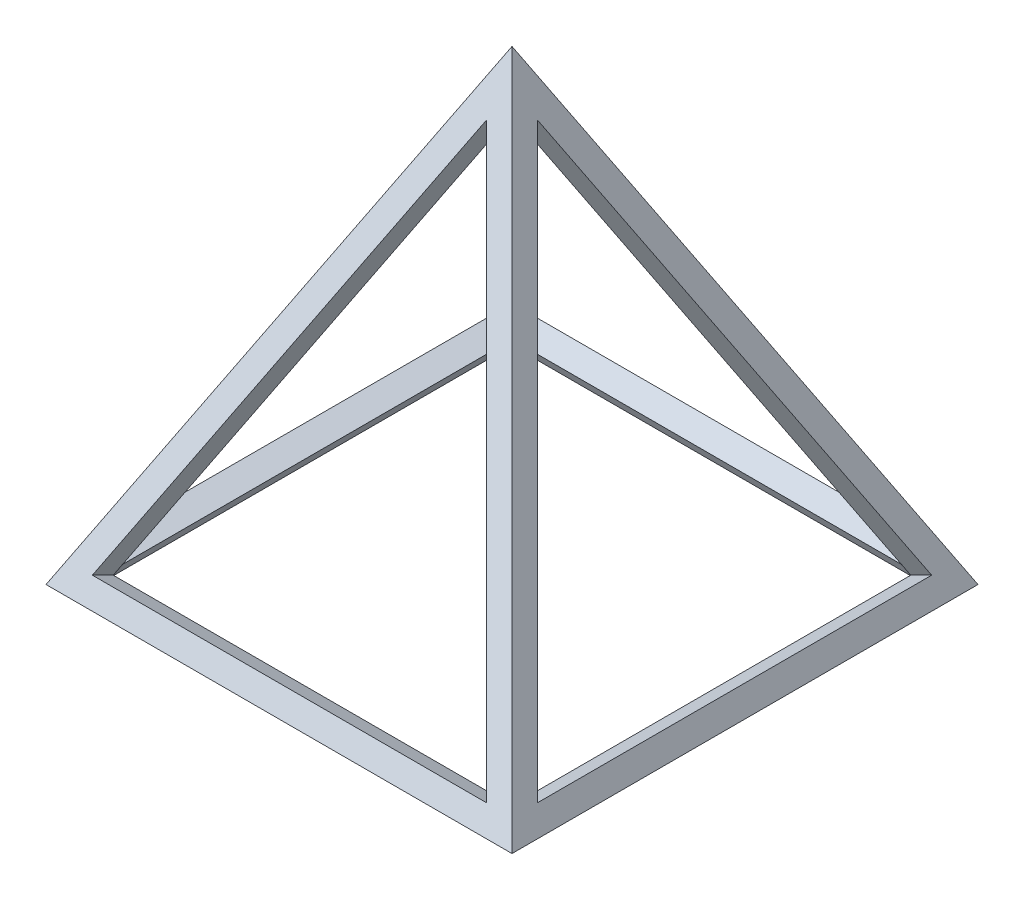
ISO-10303-21;
HEADER;
FILE_DESCRIPTION(('STEP AP214'),'2;1');
FILE_NAME('part.step','',(''),(''),'','','');
FILE_SCHEMA(('AUTOMOTIVE_DESIGN { 1 0 10303 214 1 1 1 1 }'));
ENDSEC;
DATA;
#1=APPLICATION_CONTEXT('core data for automotive mechanical design processes');
#2=APPLICATION_PROTOCOL_DEFINITION('international standard','automotive_design',2000,#1);
#3=PRODUCT_CONTEXT('',#1,'mechanical');
#4=PRODUCT('Part','Part','',(#3));
#5=PRODUCT_RELATED_PRODUCT_CATEGORY('part','',(#4));
#6=PRODUCT_DEFINITION_FORMATION('','',#4);
#7=PRODUCT_DEFINITION_CONTEXT('part definition',#1,'design');
#8=PRODUCT_DEFINITION('design','',#6,#7);
#9=PRODUCT_DEFINITION_SHAPE('','',#8);
#10=(LENGTH_UNIT() NAMED_UNIT(*) SI_UNIT(.MILLI.,.METRE.));
#11=(NAMED_UNIT(*) PLANE_ANGLE_UNIT() SI_UNIT($,.RADIAN.));
#12=(NAMED_UNIT(*) SI_UNIT($,.STERADIAN.) SOLID_ANGLE_UNIT());
#13=UNCERTAINTY_MEASURE_WITH_UNIT(LENGTH_MEASURE(1.E-05),#10,'distance_accuracy_value','');
#14=(GEOMETRIC_REPRESENTATION_CONTEXT(3) GLOBAL_UNCERTAINTY_ASSIGNED_CONTEXT((#13)) GLOBAL_UNIT_ASSIGNED_CONTEXT((#10,
#11,#12)) REPRESENTATION_CONTEXT('',''));
#15=CARTESIAN_POINT('',(0.,0.,0.));
#16=DIRECTION('',(0.,0.,1.));
#17=DIRECTION('',(1.,0.,0.));
#18=AXIS2_PLACEMENT_3D('',#15,#16,#17);
#19=CARTESIAN_POINT('',(25.,10.,-20.));
#20=DIRECTION('',(0.,-0.447213595499958,0.894427190999916));
#21=DIRECTION('',(0.,-0.894427190999916,-0.447213595499958));
#22=AXIS2_PLACEMENT_3D('',#19,#20,#21);
#23=PLANE('',#22);
#24=DIRECTION('',(0.408248290463863,-0.816496580927726,-0.408248290463863));
#25=VECTOR('',#24,1.);
#26=CARTESIAN_POINT('',(0.,44.5227744249484,-2.73861278752583));
#27=LINE('',#26,#25);
#28=CARTESIAN_POINT('',(0.,44.5227744249484,-2.73861278752583));
#29=VERTEX_POINT('',#28);
#30=CARTESIAN_POINT('',(21.1433532237243,2.2360679774998,-23.8819660112501));
#31=VERTEX_POINT('',#30);
#32=EDGE_CURVE('E314',#29,#31,#27,.T.);
#33=ORIENTED_EDGE('',*,*,#32,.F.);
#34=DIRECTION('',(0.408248290463863,0.816496580927726,0.408248290463863));
#35=VECTOR('',#34,1.);
#36=CARTESIAN_POINT('',(-21.1433532237243,2.2360679774998,-23.8819660112501));
#37=LINE('',#36,#35);
#38=CARTESIAN_POINT('',(-21.1433532237243,2.2360679774998,-23.8819660112501));
#39=VERTEX_POINT('',#38);
#40=EDGE_CURVE('E291',#39,#29,#37,.T.);
#41=ORIENTED_EDGE('',*,*,#40,.F.);
#42=DIRECTION('',(-1.,0.,0.));
#43=VECTOR('',#42,1.);
#44=CARTESIAN_POINT('',(21.1433532237243,2.2360679774998,-23.8819660112501));
#45=LINE('',#44,#43);
#46=EDGE_CURVE('E303',#31,#39,#45,.T.);
#47=ORIENTED_EDGE('',*,*,#46,.F.);
#48=EDGE_LOOP('',(#33,#41,#47));
#49=FACE_BOUND('',#48,.T.);
#50=DIRECTION('',(-0.408248290463863,0.816496580927726,0.408248290463863));
#51=VECTOR('',#50,1.);
#52=CARTESIAN_POINT('',(20.8333333333333,8.33333333333333,-20.8333333333333));
#53=LINE('',#52,#51);
#54=CARTESIAN_POINT('',(25.,0.,-25.));
#55=VERTEX_POINT('',#54);
#56=CARTESIAN_POINT('',(0.,50.,0.));
#57=VERTEX_POINT('',#56);
#58=EDGE_CURVE('E365',#55,#57,#53,.T.);
#59=ORIENTED_EDGE('',*,*,#58,.F.);
#60=DIRECTION('',(-1.,0.,0.));
#61=VECTOR('',#60,1.);
#62=CARTESIAN_POINT('',(-25.,0.,-25.));
#63=LINE('',#62,#61);
#64=CARTESIAN_POINT('',(-25.,0.,-25.));
#65=VERTEX_POINT('',#64);
#66=EDGE_CURVE('E375',#55,#65,#63,.T.);
#67=ORIENTED_EDGE('',*,*,#66,.T.);
#68=DIRECTION('',(0.408248290463863,0.816496580927726,0.408248290463863));
#69=VECTOR('',#68,1.);
#70=CARTESIAN_POINT('',(-12.5,25.,-12.5));
#71=LINE('',#70,#69);
#72=EDGE_CURVE('E368',#65,#57,#71,.T.);
#73=ORIENTED_EDGE('',*,*,#72,.T.);
#74=EDGE_LOOP('',(#59,#67,#73));
#75=FACE_BOUND('',#74,.T.);
#76=ADVANCED_FACE('F75',(#49,#75),#23,.F.);
#77=CARTESIAN_POINT('',(25.,10.,20.));
#78=DIRECTION('',(0.,0.447213595499958,0.894427190999916));
#79=DIRECTION('',(0.,-0.894427190999916,0.447213595499958));
#80=AXIS2_PLACEMENT_3D('',#77,#78,#79);
#81=PLANE('',#80);
#82=DIRECTION('',(-0.408248290463863,-0.816496580927726,0.408248290463863));
#83=VECTOR('',#82,1.);
#84=CARTESIAN_POINT('',(0.,44.5227744249484,2.73861278752582));
#85=LINE('',#84,#83);
#86=CARTESIAN_POINT('',(0.,44.5227744249484,2.73861278752582));
#87=VERTEX_POINT('',#86);
#88=CARTESIAN_POINT('',(-21.1433532237243,2.23606797749979,23.8819660112501));
#89=VERTEX_POINT('',#88);
#90=EDGE_CURVE('E229',#87,#89,#85,.T.);
#91=ORIENTED_EDGE('',*,*,#90,.F.);
#92=DIRECTION('',(-0.408248290463863,0.816496580927726,-0.408248290463863));
#93=VECTOR('',#92,1.);
#94=CARTESIAN_POINT('',(21.1433532237243,2.23606797749979,23.8819660112501));
#95=LINE('',#94,#93);
#96=CARTESIAN_POINT('',(21.1433532237243,2.23606797749979,23.8819660112501));
#97=VERTEX_POINT('',#96);
#98=EDGE_CURVE('E237',#97,#87,#95,.T.);
#99=ORIENTED_EDGE('',*,*,#98,.F.);
#100=DIRECTION('',(1.,0.,0.));
#101=VECTOR('',#100,1.);
#102=CARTESIAN_POINT('',(-21.1433532237243,2.2360679774998,23.8819660112501));
#103=LINE('',#102,#101);
#104=EDGE_CURVE('E248',#89,#97,#103,.T.);
#105=ORIENTED_EDGE('',*,*,#104,.F.);
#106=EDGE_LOOP('',(#91,#99,#105));
#107=FACE_BOUND('',#106,.T.);
#108=DIRECTION('',(1.,0.,0.));
#109=VECTOR('',#108,1.);
#110=CARTESIAN_POINT('',(-25.,0.,25.));
#111=LINE('',#110,#109);
#112=CARTESIAN_POINT('',(-25.,0.,25.));
#113=VERTEX_POINT('',#112);
#114=CARTESIAN_POINT('',(25.,0.,25.));
#115=VERTEX_POINT('',#114);
#116=EDGE_CURVE('E84',#113,#115,#111,.T.);
#117=ORIENTED_EDGE('',*,*,#116,.T.);
#118=DIRECTION('',(-0.408248290463863,0.816496580927726,-0.408248290463863));
#119=VECTOR('',#118,1.);
#120=CARTESIAN_POINT('',(20.8333333333333,8.33333333333333,20.8333333333333));
#121=LINE('',#120,#119);
#122=EDGE_CURVE('E346',#115,#57,#121,.T.);
#123=ORIENTED_EDGE('',*,*,#122,.T.);
#124=DIRECTION('',(0.408248290463863,0.816496580927726,-0.408248290463863));
#125=VECTOR('',#124,1.);
#126=CARTESIAN_POINT('',(-12.5,25.,12.5));
#127=LINE('',#126,#125);
#128=EDGE_CURVE('E12',#113,#57,#127,.T.);
#129=ORIENTED_EDGE('',*,*,#128,.F.);
#130=EDGE_LOOP('',(#117,#123,#129));
#131=FACE_BOUND('',#130,.T.);
#132=ADVANCED_FACE('F387',(#107,#131),#81,.T.);
#133=CARTESIAN_POINT('',(0.,0.,0.));
#134=DIRECTION('',(0.,1.,0.));
#135=DIRECTION('',(0.,0.,1.));
#136=AXIS2_PLACEMENT_3D('',#133,#134,#135);
#137=PLANE('',#136);
#138=DIRECTION('',(1.,0.,0.));
#139=VECTOR('',#138,1.);
#140=CARTESIAN_POINT('',(0.,0.,22.2049150281253));
#141=LINE('',#140,#139);
#142=CARTESIAN_POINT('',(-22.2049150281253,0.,22.2049150281253));
#143=VERTEX_POINT('',#142);
#144=CARTESIAN_POINT('',(22.2049150281253,0.,22.2049150281253));
#145=VERTEX_POINT('',#144);
#146=EDGE_CURVE('E347',#143,#145,#141,.T.);
#147=ORIENTED_EDGE('',*,*,#146,.T.);
#148=DIRECTION('',(0.,0.,-1.));
#149=VECTOR('',#148,1.);
#150=CARTESIAN_POINT('',(22.2049150281253,0.,0.));
#151=LINE('',#150,#149);
#152=CARTESIAN_POINT('',(22.2049150281252,0.,-22.2049150281253));
#153=VERTEX_POINT('',#152);
#154=EDGE_CURVE('E338',#145,#153,#151,.T.);
#155=ORIENTED_EDGE('',*,*,#154,.T.);
#156=DIRECTION('',(-1.,0.,0.));
#157=VECTOR('',#156,1.);
#158=CARTESIAN_POINT('',(25.,0.,-22.2049150281253));
#159=LINE('',#158,#157);
#160=CARTESIAN_POINT('',(-22.2049150281253,0.,-22.2049150281253));
#161=VERTEX_POINT('',#160);
#162=EDGE_CURVE('E348',#153,#161,#159,.T.);
#163=ORIENTED_EDGE('',*,*,#162,.T.);
#164=DIRECTION('',(0.,0.,1.));
#165=VECTOR('',#164,1.);
#166=CARTESIAN_POINT('',(-22.2049150281253,0.,-25.));
#167=LINE('',#166,#165);
#168=EDGE_CURVE('E352',#161,#143,#167,.T.);
#169=ORIENTED_EDGE('',*,*,#168,.T.);
#170=EDGE_LOOP('',(#147,#155,#163,#169));
#171=FACE_BOUND('',#170,.T.);
#172=DIRECTION('',(0.,0.,-1.));
#173=VECTOR('',#172,1.);
#174=CARTESIAN_POINT('',(25.,0.,-25.));
#175=LINE('',#174,#173);
#176=EDGE_CURVE('E372',#115,#55,#175,.T.);
#177=ORIENTED_EDGE('',*,*,#176,.F.);
#178=ORIENTED_EDGE('',*,*,#116,.F.);
#179=DIRECTION('',(0.,0.,1.));
#180=VECTOR('',#179,1.);
#181=CARTESIAN_POINT('',(-25.,0.,-25.));
#182=LINE('',#181,#180);
#183=EDGE_CURVE('E379',#65,#113,#182,.T.);
#184=ORIENTED_EDGE('',*,*,#183,.F.);
#185=ORIENTED_EDGE('',*,*,#66,.F.);
#186=EDGE_LOOP('',(#177,#178,#184,#185));
#187=FACE_BOUND('',#186,.T.);
#188=ADVANCED_FACE('F77',(#171,#187),#137,.F.);
#189=CARTESIAN_POINT('',(-25.,0.,-25.));
#190=DIRECTION('',(0.894427190999916,-0.447213595499958,0.));
#191=DIRECTION('',(0.447213595499958,0.894427190999916,0.));
#192=AXIS2_PLACEMENT_3D('',#189,#190,#191);
#193=PLANE('',#192);
#194=DIRECTION('',(0.,0.,1.));
#195=VECTOR('',#194,1.);
#196=CARTESIAN_POINT('',(-23.8819660112501,2.2360679774998,-21.1433532237243));
#197=LINE('',#196,#195);
#198=CARTESIAN_POINT('',(-23.8819660112501,2.23606797749979,-21.1433532237243));
#199=VERTEX_POINT('',#198);
#200=CARTESIAN_POINT('',(-23.8819660112501,2.23606797749979,21.1433532237243));
#201=VERTEX_POINT('',#200);
#202=EDGE_CURVE('E281',#199,#201,#197,.T.);
#203=ORIENTED_EDGE('',*,*,#202,.F.);
#204=DIRECTION('',(-0.408248290463863,-0.816496580927726,-0.408248290463863));
#205=VECTOR('',#204,1.);
#206=CARTESIAN_POINT('',(-2.73861278752584,44.5227744249484,0.));
#207=LINE('',#206,#205);
#208=CARTESIAN_POINT('',(-2.73861278752584,44.5227744249484,0.));
#209=VERTEX_POINT('',#208);
#210=EDGE_CURVE('E258',#209,#199,#207,.T.);
#211=ORIENTED_EDGE('',*,*,#210,.F.);
#212=DIRECTION('',(0.408248290463863,0.816496580927726,-0.408248290463863));
#213=VECTOR('',#212,1.);
#214=CARTESIAN_POINT('',(-23.8819660112501,2.23606797749979,21.1433532237243));
#215=LINE('',#214,#213);
#216=EDGE_CURVE('E270',#201,#209,#215,.T.);
#217=ORIENTED_EDGE('',*,*,#216,.F.);
#218=EDGE_LOOP('',(#203,#211,#217));
#219=FACE_BOUND('',#218,.T.);
#220=ORIENTED_EDGE('',*,*,#183,.T.);
#221=ORIENTED_EDGE('',*,*,#128,.T.);
#222=ORIENTED_EDGE('',*,*,#72,.F.);
#223=EDGE_LOOP('',(#220,#221,#222));
#224=FACE_BOUND('',#223,.T.);
#225=ADVANCED_FACE('F396',(#219,#224),#193,.F.);
#226=CARTESIAN_POINT('',(25.,0.,-25.));
#227=DIRECTION('',(0.894427190999916,0.447213595499958,0.));
#228=DIRECTION('',(-0.447213595499958,0.894427190999916,0.));
#229=AXIS2_PLACEMENT_3D('',#226,#227,#228);
#230=PLANE('',#229);
#231=DIRECTION('',(0.,0.,-1.));
#232=VECTOR('',#231,1.);
#233=CARTESIAN_POINT('',(23.8819660112501,2.23606797749979,21.1433532237243));
#234=LINE('',#233,#232);
#235=CARTESIAN_POINT('',(23.8819660112501,2.23606797749979,21.1433532237243));
#236=VERTEX_POINT('',#235);
#237=CARTESIAN_POINT('',(23.8819660112501,2.23606797749979,-21.1433532237243));
#238=VERTEX_POINT('',#237);
#239=EDGE_CURVE('E91',#236,#238,#234,.T.);
#240=ORIENTED_EDGE('',*,*,#239,.F.);
#241=DIRECTION('',(0.408248290463863,-0.816496580927726,0.408248290463863));
#242=VECTOR('',#241,1.);
#243=CARTESIAN_POINT('',(2.73861278752582,44.5227744249484,0.));
#244=LINE('',#243,#242);
#245=CARTESIAN_POINT('',(2.73861278752582,44.5227744249484,0.));
#246=VERTEX_POINT('',#245);
#247=EDGE_CURVE('E213',#246,#236,#244,.T.);
#248=ORIENTED_EDGE('',*,*,#247,.F.);
#249=DIRECTION('',(-0.408248290463863,0.816496580927726,0.408248290463863));
#250=VECTOR('',#249,1.);
#251=CARTESIAN_POINT('',(23.8819660112501,2.23606797749979,-21.1433532237243));
#252=LINE('',#251,#250);
#253=EDGE_CURVE('E217',#238,#246,#252,.T.);
#254=ORIENTED_EDGE('',*,*,#253,.F.);
#255=EDGE_LOOP('',(#240,#248,#254));
#256=FACE_BOUND('',#255,.T.);
#257=ORIENTED_EDGE('',*,*,#58,.T.);
#258=ORIENTED_EDGE('',*,*,#122,.F.);
#259=ORIENTED_EDGE('',*,*,#176,.T.);
#260=EDGE_LOOP('',(#257,#258,#259));
#261=FACE_BOUND('',#260,.T.);
#262=ADVANCED_FACE('F393',(#256,#261),#230,.T.);
#263=CARTESIAN_POINT('',(25.,8.88196601125011,-17.7639320225002));
#264=DIRECTION('',(0.,-0.447213595499958,0.894427190999916));
#265=DIRECTION('',(0.,-0.894427190999916,-0.447213595499958));
#266=AXIS2_PLACEMENT_3D('',#263,#264,#265);
#267=PLANE('',#266);
#268=DIRECTION('',(0.408248290463863,0.816496580927726,0.408248290463863));
#269=VECTOR('',#268,1.);
#270=CARTESIAN_POINT('',(-21.1433532237243,1.1180339887499,-21.6458980337503));
#271=LINE('',#270,#269);
#272=CARTESIAN_POINT('',(-21.1433532237243,1.1180339887499,-21.6458980337503));
#273=VERTEX_POINT('',#272);
#274=CARTESIAN_POINT('',(0.,43.4047404361985,-0.502544810026044));
#275=VERTEX_POINT('',#274);
#276=EDGE_CURVE('E298',#273,#275,#271,.T.);
#277=ORIENTED_EDGE('',*,*,#276,.T.);
#278=DIRECTION('',(0.408248290463863,-0.816496580927726,-0.408248290463863));
#279=VECTOR('',#278,1.);
#280=CARTESIAN_POINT('',(0.,43.4047404361985,-0.502544810026044));
#281=LINE('',#280,#279);
#282=CARTESIAN_POINT('',(21.1433532237243,1.1180339887499,-21.6458980337503));
#283=VERTEX_POINT('',#282);
#284=EDGE_CURVE('E302',#275,#283,#281,.T.);
#285=ORIENTED_EDGE('',*,*,#284,.T.);
#286=DIRECTION('',(-1.,0.,0.));
#287=VECTOR('',#286,1.);
#288=CARTESIAN_POINT('',(21.1433532237243,1.1180339887499,-21.6458980337503));
#289=LINE('',#288,#287);
#290=EDGE_CURVE('E307',#283,#273,#289,.T.);
#291=ORIENTED_EDGE('',*,*,#290,.T.);
#292=EDGE_LOOP('',(#277,#285,#291));
#293=FACE_BOUND('',#292,.T.);
#294=DIRECTION('',(-0.408248290463863,0.816496580927726,0.408248290463863));
#295=VECTOR('',#294,1.);
#296=CARTESIAN_POINT('',(18.9699433520835,6.46994335208351,-18.9699433520835));
#297=LINE('',#296,#295);
#298=CARTESIAN_POINT('',(0.,44.4098300562505,0.));
#299=VERTEX_POINT('',#298);
#300=EDGE_CURVE('E331',#153,#299,#297,.T.);
#301=ORIENTED_EDGE('',*,*,#300,.T.);
#302=DIRECTION('',(0.408248290463863,0.816496580927726,0.408248290463863));
#303=VECTOR('',#302,1.);
#304=CARTESIAN_POINT('',(-10.6366100187502,23.1366100187502,-10.6366100187502));
#305=LINE('',#304,#303);
#306=EDGE_CURVE('E334',#161,#299,#305,.T.);
#307=ORIENTED_EDGE('',*,*,#306,.F.);
#308=ORIENTED_EDGE('',*,*,#162,.F.);
#309=EDGE_LOOP('',(#301,#307,#308));
#310=FACE_BOUND('',#309,.T.);
#311=ADVANCED_FACE('F404',(#293,#310),#267,.T.);
#312=CARTESIAN_POINT('',(25.,8.8819660112501,17.7639320225002));
#313=DIRECTION('',(0.,0.447213595499958,0.894427190999916));
#314=DIRECTION('',(0.,-0.894427190999916,0.447213595499958));
#315=AXIS2_PLACEMENT_3D('',#312,#313,#314);
#316=PLANE('',#315);
#317=DIRECTION('',(-0.408248290463863,0.816496580927726,-0.408248290463863));
#318=VECTOR('',#317,1.);
#319=CARTESIAN_POINT('',(21.1433532237243,1.1180339887499,21.6458980337503));
#320=LINE('',#319,#318);
#321=CARTESIAN_POINT('',(21.1433532237243,1.11803398874989,21.6458980337503));
#322=VERTEX_POINT('',#321);
#323=CARTESIAN_POINT('',(0.,43.4047404361985,0.502544810026034));
#324=VERTEX_POINT('',#323);
#325=EDGE_CURVE('E241',#322,#324,#320,.T.);
#326=ORIENTED_EDGE('',*,*,#325,.T.);
#327=DIRECTION('',(-0.408248290463863,-0.816496580927726,0.408248290463863));
#328=VECTOR('',#327,1.);
#329=CARTESIAN_POINT('',(0.,43.4047404361985,0.502544810026034));
#330=LINE('',#329,#328);
#331=CARTESIAN_POINT('',(-21.1433532237243,1.1180339887499,21.6458980337503));
#332=VERTEX_POINT('',#331);
#333=EDGE_CURVE('E232',#324,#332,#330,.T.);
#334=ORIENTED_EDGE('',*,*,#333,.T.);
#335=DIRECTION('',(1.,0.,0.));
#336=VECTOR('',#335,1.);
#337=CARTESIAN_POINT('',(-21.1433532237243,1.1180339887499,21.6458980337503));
#338=LINE('',#337,#336);
#339=EDGE_CURVE('E236',#332,#322,#338,.T.);
#340=ORIENTED_EDGE('',*,*,#339,.T.);
#341=EDGE_LOOP('',(#326,#334,#340));
#342=FACE_BOUND('',#341,.T.);
#343=ORIENTED_EDGE('',*,*,#146,.F.);
#344=DIRECTION('',(0.408248290463863,0.816496580927726,-0.408248290463863));
#345=VECTOR('',#344,1.);
#346=CARTESIAN_POINT('',(-10.6366100187502,23.1366100187502,10.6366100187502));
#347=LINE('',#346,#345);
#348=EDGE_CURVE('E342',#143,#299,#347,.T.);
#349=ORIENTED_EDGE('',*,*,#348,.T.);
#350=DIRECTION('',(-0.408248290463863,0.816496580927726,-0.408248290463863));
#351=VECTOR('',#350,1.);
#352=CARTESIAN_POINT('',(18.9699433520835,6.46994335208351,18.9699433520835));
#353=LINE('',#352,#351);
#354=EDGE_CURVE('E324',#145,#299,#353,.T.);
#355=ORIENTED_EDGE('',*,*,#354,.F.);
#356=EDGE_LOOP('',(#343,#349,#355));
#357=FACE_BOUND('',#356,.T.);
#358=ADVANCED_FACE('F431',(#342,#357),#316,.F.);
#359=CARTESIAN_POINT('',(-22.7639320225002,-1.11803398874989,-25.));
#360=DIRECTION('',(0.894427190999916,-0.447213595499958,0.));
#361=DIRECTION('',(0.447213595499958,0.894427190999916,0.));
#362=AXIS2_PLACEMENT_3D('',#359,#360,#361);
#363=PLANE('',#362);
#364=DIRECTION('',(-0.408248290463863,-0.816496580927726,-0.408248290463863));
#365=VECTOR('',#364,1.);
#366=CARTESIAN_POINT('',(-0.502544810026048,43.4047404361985,0.));
#367=LINE('',#366,#365);
#368=CARTESIAN_POINT('',(-0.502544810026048,43.4047404361985,0.));
#369=VERTEX_POINT('',#368);
#370=CARTESIAN_POINT('',(-21.6458980337503,1.1180339887499,-21.1433532237243));
#371=VERTEX_POINT('',#370);
#372=EDGE_CURVE('E265',#369,#371,#367,.T.);
#373=ORIENTED_EDGE('',*,*,#372,.T.);
#374=DIRECTION('',(0.,0.,1.));
#375=VECTOR('',#374,1.);
#376=CARTESIAN_POINT('',(-21.6458980337503,1.1180339887499,-21.1433532237243));
#377=LINE('',#376,#375);
#378=CARTESIAN_POINT('',(-21.6458980337503,1.11803398874989,21.1433532237243));
#379=VERTEX_POINT('',#378);
#380=EDGE_CURVE('E269',#371,#379,#377,.T.);
#381=ORIENTED_EDGE('',*,*,#380,.T.);
#382=DIRECTION('',(0.408248290463863,0.816496580927726,-0.408248290463863));
#383=VECTOR('',#382,1.);
#384=CARTESIAN_POINT('',(-21.6458980337503,1.1180339887499,21.1433532237243));
#385=LINE('',#384,#383);
#386=EDGE_CURVE('E274',#379,#369,#385,.T.);
#387=ORIENTED_EDGE('',*,*,#386,.T.);
#388=EDGE_LOOP('',(#373,#381,#387));
#389=FACE_BOUND('',#388,.T.);
#390=ORIENTED_EDGE('',*,*,#168,.F.);
#391=ORIENTED_EDGE('',*,*,#306,.T.);
#392=ORIENTED_EDGE('',*,*,#348,.F.);
#393=EDGE_LOOP('',(#390,#391,#392));
#394=FACE_BOUND('',#393,.T.);
#395=ADVANCED_FACE('F439',(#389,#394),#363,.T.);
#396=CARTESIAN_POINT('',(22.7639320225002,-1.11803398874989,-25.));
#397=DIRECTION('',(0.894427190999916,0.447213595499958,0.));
#398=DIRECTION('',(-0.447213595499958,0.894427190999916,0.));
#399=AXIS2_PLACEMENT_3D('',#396,#397,#398);
#400=PLANE('',#399);
#401=DIRECTION('',(0.408248290463863,-0.816496580927726,0.408248290463863));
#402=VECTOR('',#401,1.);
#403=CARTESIAN_POINT('',(0.50254481002603,43.4047404361985,0.));
#404=LINE('',#403,#402);
#405=CARTESIAN_POINT('',(0.502544810026033,43.4047404361985,0.));
#406=VERTEX_POINT('',#405);
#407=CARTESIAN_POINT('',(21.6458980337503,1.1180339887499,21.1433532237243));
#408=VERTEX_POINT('',#407);
#409=EDGE_CURVE('E99',#406,#408,#404,.T.);
#410=ORIENTED_EDGE('',*,*,#409,.T.);
#411=DIRECTION('',(0.,0.,-1.));
#412=VECTOR('',#411,1.);
#413=CARTESIAN_POINT('',(21.6458980337503,1.1180339887499,21.1433532237243));
#414=LINE('',#413,#412);
#415=CARTESIAN_POINT('',(21.6458980337503,1.1180339887499,-21.1433532237243));
#416=VERTEX_POINT('',#415);
#417=EDGE_CURVE('E197',#408,#416,#414,.T.);
#418=ORIENTED_EDGE('',*,*,#417,.T.);
#419=DIRECTION('',(-0.408248290463863,0.816496580927726,0.408248290463863));
#420=VECTOR('',#419,1.);
#421=CARTESIAN_POINT('',(21.6458980337503,1.1180339887499,-21.1433532237243));
#422=LINE('',#421,#420);
#423=EDGE_CURVE('E205',#416,#406,#422,.T.);
#424=ORIENTED_EDGE('',*,*,#423,.T.);
#425=EDGE_LOOP('',(#410,#418,#424));
#426=FACE_BOUND('',#425,.T.);
#427=ORIENTED_EDGE('',*,*,#300,.F.);
#428=ORIENTED_EDGE('',*,*,#154,.F.);
#429=ORIENTED_EDGE('',*,*,#354,.T.);
#430=EDGE_LOOP('',(#427,#428,#429));
#431=FACE_BOUND('',#430,.T.);
#432=ADVANCED_FACE('F210',(#426,#431),#400,.F.);
#433=CARTESIAN_POINT('',(-21.1433532237243,1.1180339887499,-21.6458980337503));
#434=DIRECTION('',(-0.912870929175277,0.365148371670111,0.182574185835056));
#435=DIRECTION('',(-0.371390676354104,-0.928476690885259,0.));
#436=AXIS2_PLACEMENT_3D('',#433,#434,#435);
#437=PLANE('',#436);
#438=ORIENTED_EDGE('',*,*,#40,.T.);
#439=DIRECTION('',(0.,0.447213595499958,-0.894427190999916));
#440=VECTOR('',#439,1.);
#441=CARTESIAN_POINT('',(0.,43.4047404361985,-0.502544810026044));
#442=LINE('',#441,#440);
#443=EDGE_CURVE('E311',#275,#29,#442,.T.);
#444=ORIENTED_EDGE('',*,*,#443,.F.);
#445=ORIENTED_EDGE('',*,*,#276,.F.);
#446=DIRECTION('',(0.,0.447213595499958,-0.894427190999916));
#447=VECTOR('',#446,1.);
#448=CARTESIAN_POINT('',(-21.1433532237243,1.1180339887499,-21.6458980337503));
#449=LINE('',#448,#447);
#450=EDGE_CURVE('E321',#273,#39,#449,.T.);
#451=ORIENTED_EDGE('',*,*,#450,.T.);
#452=EDGE_LOOP('',(#438,#444,#445,#451));
#453=FACE_BOUND('',#452,.T.);
#454=ADVANCED_FACE('F425',(#453),#437,.F.);
#455=CARTESIAN_POINT('',(21.1433532237243,1.1180339887499,-21.6458980337503));
#456=DIRECTION('',(0.,-0.894427190999916,-0.447213595499958));
#457=DIRECTION('',(0.,0.447213595499958,-0.894427190999916));
#458=AXIS2_PLACEMENT_3D('',#455,#456,#457);
#459=PLANE('',#458);
#460=ORIENTED_EDGE('',*,*,#46,.T.);
#461=ORIENTED_EDGE('',*,*,#450,.F.);
#462=ORIENTED_EDGE('',*,*,#290,.F.);
#463=DIRECTION('',(0.,0.447213595499958,-0.894427190999916));
#464=VECTOR('',#463,1.);
#465=CARTESIAN_POINT('',(21.1433532237243,1.1180339887499,-21.6458980337503));
#466=LINE('',#465,#464);
#467=EDGE_CURVE('E325',#283,#31,#466,.T.);
#468=ORIENTED_EDGE('',*,*,#467,.T.);
#469=EDGE_LOOP('',(#460,#461,#462,#468));
#470=FACE_BOUND('',#469,.T.);
#471=ADVANCED_FACE('F427',(#470),#459,.F.);
#472=CARTESIAN_POINT('',(0.,43.4047404361985,-0.502544810026044));
#473=DIRECTION('',(0.912870929175277,0.365148371670111,0.182574185835055));
#474=DIRECTION('',(-0.371390676354104,0.92847669088526,0.));
#475=AXIS2_PLACEMENT_3D('',#472,#473,#474);
#476=PLANE('',#475);
#477=ORIENTED_EDGE('',*,*,#32,.T.);
#478=ORIENTED_EDGE('',*,*,#467,.F.);
#479=ORIENTED_EDGE('',*,*,#284,.F.);
#480=ORIENTED_EDGE('',*,*,#443,.T.);
#481=EDGE_LOOP('',(#477,#478,#479,#480));
#482=FACE_BOUND('',#481,.T.);
#483=ADVANCED_FACE('F421',(#482),#476,.F.);
#484=CARTESIAN_POINT('',(-0.502544810026048,43.4047404361985,0.));
#485=DIRECTION('',(0.182574185835055,0.36514837167011,-0.912870929175277));
#486=DIRECTION('',(0.,0.928476690885259,0.371390676354103));
#487=AXIS2_PLACEMENT_3D('',#484,#485,#486);
#488=PLANE('',#487);
#489=ORIENTED_EDGE('',*,*,#210,.T.);
#490=DIRECTION('',(-0.894427190999916,0.447213595499958,0.));
#491=VECTOR('',#490,1.);
#492=CARTESIAN_POINT('',(-21.6458980337503,1.1180339887499,-21.1433532237243));
#493=LINE('',#492,#491);
#494=EDGE_CURVE('E278',#371,#199,#493,.T.);
#495=ORIENTED_EDGE('',*,*,#494,.F.);
#496=ORIENTED_EDGE('',*,*,#372,.F.);
#497=DIRECTION('',(-0.894427190999916,0.447213595499958,0.));
#498=VECTOR('',#497,1.);
#499=CARTESIAN_POINT('',(-0.502544810026048,43.4047404361985,0.));
#500=LINE('',#499,#498);
#501=EDGE_CURVE('E288',#369,#209,#500,.T.);
#502=ORIENTED_EDGE('',*,*,#501,.T.);
#503=EDGE_LOOP('',(#489,#495,#496,#502));
#504=FACE_BOUND('',#503,.T.);
#505=ADVANCED_FACE('F455',(#504),#488,.F.);
#506=CARTESIAN_POINT('',(-21.6458980337503,1.1180339887499,21.1433532237243));
#507=DIRECTION('',(0.182574185835056,0.365148371670111,0.912870929175277));
#508=DIRECTION('',(0.,-0.928476690885259,0.371390676354104));
#509=AXIS2_PLACEMENT_3D('',#506,#507,#508);
#510=PLANE('',#509);
#511=ORIENTED_EDGE('',*,*,#216,.T.);
#512=ORIENTED_EDGE('',*,*,#501,.F.);
#513=ORIENTED_EDGE('',*,*,#386,.F.);
#514=DIRECTION('',(-0.894427190999916,0.447213595499958,0.));
#515=VECTOR('',#514,1.);
#516=CARTESIAN_POINT('',(-21.6458980337503,1.1180339887499,21.1433532237243));
#517=LINE('',#516,#515);
#518=EDGE_CURVE('E292',#379,#201,#517,.T.);
#519=ORIENTED_EDGE('',*,*,#518,.T.);
#520=EDGE_LOOP('',(#511,#512,#513,#519));
#521=FACE_BOUND('',#520,.T.);
#522=ADVANCED_FACE('F460',(#521),#510,.F.);
#523=CARTESIAN_POINT('',(-21.6458980337503,1.1180339887499,-21.1433532237243));
#524=DIRECTION('',(-0.447213595499958,-0.894427190999916,0.));
#525=DIRECTION('',(0.894427190999916,-0.447213595499958,0.));
#526=AXIS2_PLACEMENT_3D('',#523,#524,#525);
#527=PLANE('',#526);
#528=ORIENTED_EDGE('',*,*,#202,.T.);
#529=ORIENTED_EDGE('',*,*,#518,.F.);
#530=ORIENTED_EDGE('',*,*,#380,.F.);
#531=ORIENTED_EDGE('',*,*,#494,.T.);
#532=EDGE_LOOP('',(#528,#529,#530,#531));
#533=FACE_BOUND('',#532,.T.);
#534=ADVANCED_FACE('F462',(#533),#527,.F.);
#535=CARTESIAN_POINT('',(0.,43.4047404361985,0.502544810026034));
#536=DIRECTION('',(-0.912870929175277,0.365148371670111,-0.182574185835055));
#537=DIRECTION('',(-0.371390676354104,-0.92847669088526,0.));
#538=AXIS2_PLACEMENT_3D('',#535,#536,#537);
#539=PLANE('',#538);
#540=ORIENTED_EDGE('',*,*,#90,.T.);
#541=DIRECTION('',(0.,0.447213595499958,0.894427190999916));
#542=VECTOR('',#541,1.);
#543=CARTESIAN_POINT('',(-21.1433532237243,1.1180339887499,21.6458980337503));
#544=LINE('',#543,#542);
#545=EDGE_CURVE('E245',#332,#89,#544,.T.);
#546=ORIENTED_EDGE('',*,*,#545,.F.);
#547=ORIENTED_EDGE('',*,*,#333,.F.);
#548=DIRECTION('',(0.,0.447213595499958,0.894427190999916));
#549=VECTOR('',#548,1.);
#550=CARTESIAN_POINT('',(0.,43.4047404361985,0.502544810026034));
#551=LINE('',#550,#549);
#552=EDGE_CURVE('E255',#324,#87,#551,.T.);
#553=ORIENTED_EDGE('',*,*,#552,.T.);
#554=EDGE_LOOP('',(#540,#546,#547,#553));
#555=FACE_BOUND('',#554,.T.);
#556=ADVANCED_FACE('F465',(#555),#539,.F.);
#557=CARTESIAN_POINT('',(21.1433532237243,1.1180339887499,21.6458980337503));
#558=DIRECTION('',(0.912870929175277,0.365148371670111,-0.182574185835055));
#559=DIRECTION('',(-0.371390676354104,0.92847669088526,0.));
#560=AXIS2_PLACEMENT_3D('',#557,#558,#559);
#561=PLANE('',#560);
#562=ORIENTED_EDGE('',*,*,#98,.T.);
#563=ORIENTED_EDGE('',*,*,#552,.F.);
#564=ORIENTED_EDGE('',*,*,#325,.F.);
#565=DIRECTION('',(0.,0.447213595499958,0.894427190999916));
#566=VECTOR('',#565,1.);
#567=CARTESIAN_POINT('',(21.1433532237243,1.1180339887499,21.6458980337503));
#568=LINE('',#567,#566);
#569=EDGE_CURVE('E259',#322,#97,#568,.T.);
#570=ORIENTED_EDGE('',*,*,#569,.T.);
#571=EDGE_LOOP('',(#562,#563,#564,#570));
#572=FACE_BOUND('',#571,.T.);
#573=ADVANCED_FACE('F472',(#572),#561,.F.);
#574=CARTESIAN_POINT('',(-21.1433532237243,1.1180339887499,21.6458980337503));
#575=DIRECTION('',(0.,-0.894427190999916,0.447213595499958));
#576=DIRECTION('',(0.,-0.447213595499958,-0.894427190999916));
#577=AXIS2_PLACEMENT_3D('',#574,#575,#576);
#578=PLANE('',#577);
#579=ORIENTED_EDGE('',*,*,#104,.T.);
#580=ORIENTED_EDGE('',*,*,#569,.F.);
#581=ORIENTED_EDGE('',*,*,#339,.F.);
#582=ORIENTED_EDGE('',*,*,#545,.T.);
#583=EDGE_LOOP('',(#579,#580,#581,#582));
#584=FACE_BOUND('',#583,.T.);
#585=ADVANCED_FACE('F474',(#584),#578,.F.);
#586=CARTESIAN_POINT('',(21.6458980337503,1.1180339887499,21.1433532237243));
#587=DIRECTION('',(0.447213595499958,-0.894427190999916,0.));
#588=DIRECTION('',(0.894427190999916,0.447213595499958,0.));
#589=AXIS2_PLACEMENT_3D('',#586,#587,#588);
#590=PLANE('',#589);
#591=ORIENTED_EDGE('',*,*,#239,.T.);
#592=DIRECTION('',(0.894427190999916,0.447213595499958,0.));
#593=VECTOR('',#592,1.);
#594=CARTESIAN_POINT('',(21.6458980337503,1.1180339887499,-21.1433532237243));
#595=LINE('',#594,#593);
#596=EDGE_CURVE('E193',#416,#238,#595,.T.);
#597=ORIENTED_EDGE('',*,*,#596,.F.);
#598=ORIENTED_EDGE('',*,*,#417,.F.);
#599=DIRECTION('',(0.894427190999916,0.447213595499958,0.));
#600=VECTOR('',#599,1.);
#601=CARTESIAN_POINT('',(21.6458980337503,1.1180339887499,21.1433532237243));
#602=LINE('',#601,#600);
#603=EDGE_CURVE('E226',#408,#236,#602,.T.);
#604=ORIENTED_EDGE('',*,*,#603,.T.);
#605=EDGE_LOOP('',(#591,#597,#598,#604));
#606=FACE_BOUND('',#605,.T.);
#607=ADVANCED_FACE('F195',(#606),#590,.F.);
#608=CARTESIAN_POINT('',(0.50254481002603,43.4047404361985,0.));
#609=DIRECTION('',(-0.182574185835055,0.365148371670111,0.912870929175277));
#610=DIRECTION('',(0.,-0.928476690885259,0.371390676354104));
#611=AXIS2_PLACEMENT_3D('',#608,#609,#610);
#612=PLANE('',#611);
#613=ORIENTED_EDGE('',*,*,#247,.T.);
#614=ORIENTED_EDGE('',*,*,#603,.F.);
#615=ORIENTED_EDGE('',*,*,#409,.F.);
#616=DIRECTION('',(0.894427190999916,0.447213595499958,0.));
#617=VECTOR('',#616,1.);
#618=CARTESIAN_POINT('',(0.50254481002603,43.4047404361985,0.));
#619=LINE('',#618,#617);
#620=EDGE_CURVE('E202',#406,#246,#619,.T.);
#621=ORIENTED_EDGE('',*,*,#620,.T.);
#622=EDGE_LOOP('',(#613,#614,#615,#621));
#623=FACE_BOUND('',#622,.T.);
#624=ADVANCED_FACE('F483',(#623),#612,.F.);
#625=CARTESIAN_POINT('',(21.6458980337503,1.1180339887499,-21.1433532237243));
#626=DIRECTION('',(-0.182574185835055,0.36514837167011,-0.912870929175277));
#627=DIRECTION('',(0.,0.92847669088526,0.371390676354103));
#628=AXIS2_PLACEMENT_3D('',#625,#626,#627);
#629=PLANE('',#628);
#630=ORIENTED_EDGE('',*,*,#253,.T.);
#631=ORIENTED_EDGE('',*,*,#620,.F.);
#632=ORIENTED_EDGE('',*,*,#423,.F.);
#633=ORIENTED_EDGE('',*,*,#596,.T.);
#634=EDGE_LOOP('',(#630,#631,#632,#633));
#635=FACE_BOUND('',#634,.T.);
#636=ADVANCED_FACE('F206',(#635),#629,.F.);
#637=CLOSED_SHELL('',(#76,#132,#188,#225,#262,#311,#358,#395,#432,#454,#471,#483,#505,#522,#534,
#556,#573,#585,#607,#624,#636));
#638=MANIFOLD_SOLID_BREP('B2',#637);
#639=ADVANCED_BREP_SHAPE_REPRESENTATION('',(#18,#638),#14);
#640=SHAPE_DEFINITION_REPRESENTATION(#9,#639);
ENDSEC;
END-ISO-10303-21;
